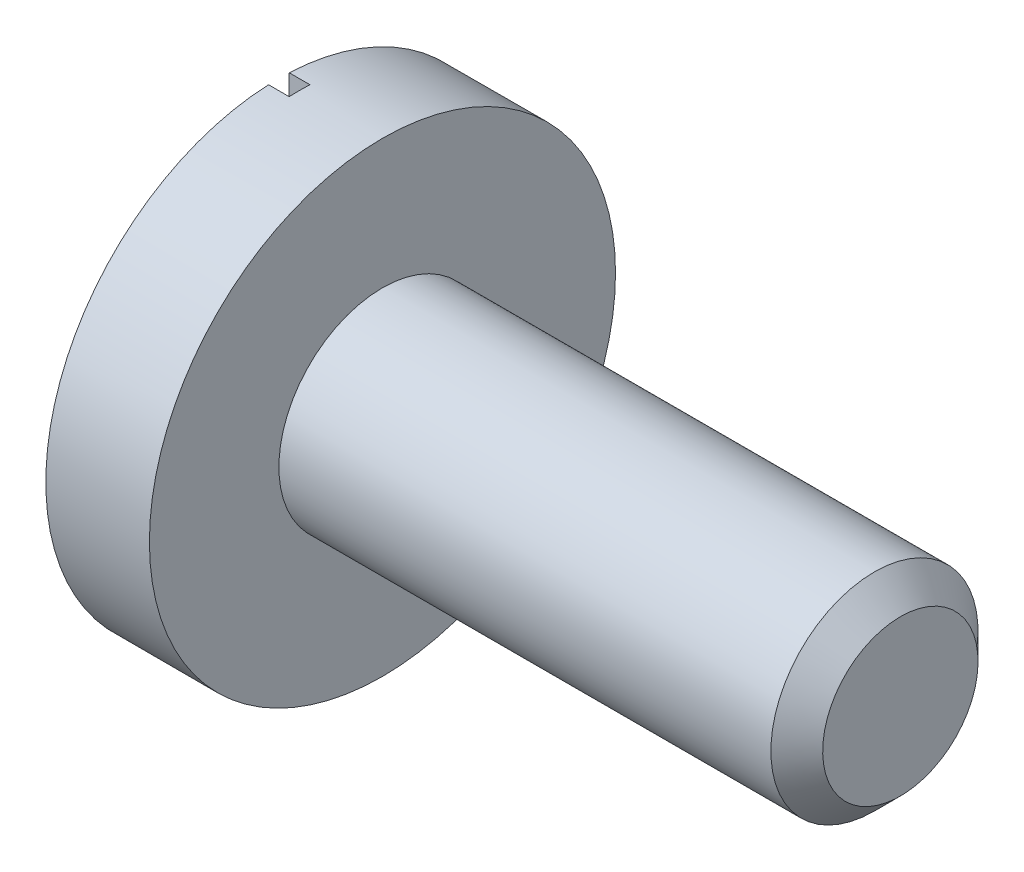
ISO-10303-21;
HEADER;
FILE_DESCRIPTION(('STEP AP214'),'2;1');
FILE_NAME('part.step','',(''),(''),'','','');
FILE_SCHEMA(('AUTOMOTIVE_DESIGN { 1 0 10303 214 1 1 1 1 }'));
ENDSEC;
DATA;
#1=APPLICATION_CONTEXT('core data for automotive mechanical design processes');
#2=APPLICATION_PROTOCOL_DEFINITION('international standard','automotive_design',2000,#1);
#3=PRODUCT_CONTEXT('',#1,'mechanical');
#4=PRODUCT('Part','Part','',(#3));
#5=PRODUCT_RELATED_PRODUCT_CATEGORY('part','',(#4));
#6=PRODUCT_DEFINITION_FORMATION('','',#4);
#7=PRODUCT_DEFINITION_CONTEXT('part definition',#1,'design');
#8=PRODUCT_DEFINITION('design','',#6,#7);
#9=PRODUCT_DEFINITION_SHAPE('','',#8);
#10=(LENGTH_UNIT() NAMED_UNIT(*) SI_UNIT(.MILLI.,.METRE.));
#11=(NAMED_UNIT(*) PLANE_ANGLE_UNIT() SI_UNIT($,.RADIAN.));
#12=(NAMED_UNIT(*) SI_UNIT($,.STERADIAN.) SOLID_ANGLE_UNIT());
#13=UNCERTAINTY_MEASURE_WITH_UNIT(LENGTH_MEASURE(1.E-05),#10,'distance_accuracy_value','');
#14=(GEOMETRIC_REPRESENTATION_CONTEXT(3) GLOBAL_UNCERTAINTY_ASSIGNED_CONTEXT((#13)) GLOBAL_UNIT_ASSIGNED_CONTEXT((#10,
#11,#12)) REPRESENTATION_CONTEXT('',''));
#15=CARTESIAN_POINT('',(0.,0.,0.));
#16=DIRECTION('',(0.,0.,1.));
#17=DIRECTION('',(1.,0.,0.));
#18=AXIS2_PLACEMENT_3D('',#15,#16,#17);
#19=CARTESIAN_POINT('',(0.,0.,0.));
#20=DIRECTION('',(-1.,0.,0.));
#21=DIRECTION('',(0.,-1.,0.));
#22=AXIS2_PLACEMENT_3D('',#19,#20,#21);
#23=PLANE('',#22);
#24=DIRECTION('',(0.,-1.,0.));
#25=VECTOR('',#24,1.);
#26=CARTESIAN_POINT('',(0.,1.12388833964945,-0.0500000000000003));
#27=LINE('',#26,#25);
#28=CARTESIAN_POINT('',(0.,1.12388833964945,-0.0500000000000001));
#29=VERTEX_POINT('',#28);
#30=CARTESIAN_POINT('',(0.,-1.12388833964945,-0.05));
#31=VERTEX_POINT('',#30);
#32=EDGE_CURVE('E75',#29,#31,#27,.T.);
#33=ORIENTED_EDGE('',*,*,#32,.F.);
#34=CARTESIAN_POINT('',(0.,0.,0.));
#35=DIRECTION('',(1.,0.,0.));
#36=DIRECTION('',(0.,1.,0.));
#37=AXIS2_PLACEMENT_3D('',#34,#35,#36);
#38=CIRCLE('',#37,1.125);
#39=EDGE_CURVE('E111',#31,#29,#38,.T.);
#40=ORIENTED_EDGE('',*,*,#39,.F.);
#41=EDGE_LOOP('',(#33,#40));
#42=FACE_BOUND('',#41,.T.);
#43=ADVANCED_FACE('F36',(#42),#23,.T.);
#44=DIRECTION('',(0.,1.,0.));
#45=VECTOR('',#44,1.);
#46=CARTESIAN_POINT('',(0.,1.12388833964945,0.0499999999999994));
#47=LINE('',#46,#45);
#48=CARTESIAN_POINT('',(0.,-1.12388833964945,0.0499999999999999));
#49=VERTEX_POINT('',#48);
#50=CARTESIAN_POINT('',(0.,1.12388833964945,0.0499999999999994));
#51=VERTEX_POINT('',#50);
#52=EDGE_CURVE('E230',#49,#51,#47,.T.);
#53=ORIENTED_EDGE('',*,*,#52,.F.);
#54=EDGE_CURVE('E97',#51,#49,#38,.T.);
#55=ORIENTED_EDGE('',*,*,#54,.F.);
#56=EDGE_LOOP('',(#53,#55));
#57=FACE_BOUND('',#56,.T.);
#58=ADVANCED_FACE('F129',(#57),#23,.T.);
#59=CARTESIAN_POINT('',(3.,0.,0.));
#60=DIRECTION('',(1.,0.,0.));
#61=DIRECTION('',(0.,1.,0.));
#62=AXIS2_PLACEMENT_3D('',#59,#60,#61);
#63=CYLINDRICAL_SURFACE('',#62,1.125);
#64=DIRECTION('',(-1.,0.,0.));
#65=VECTOR('',#64,1.);
#66=CARTESIAN_POINT('',(0.1,1.12388833964945,-0.0500000000000001));
#67=LINE('',#66,#65);
#68=CARTESIAN_POINT('',(0.1,1.12388833964945,-0.0500000000000001));
#69=VERTEX_POINT('',#68);
#70=EDGE_CURVE('E99',#69,#29,#67,.T.);
#71=ORIENTED_EDGE('',*,*,#70,.F.);
#72=CARTESIAN_POINT('',(0.1,0.,0.));
#73=DIRECTION('',(-1.,0.,0.));
#74=DIRECTION('',(0.,-1.,0.));
#75=AXIS2_PLACEMENT_3D('',#72,#73,#74);
#76=CIRCLE('',#75,1.125);
#77=CARTESIAN_POINT('',(0.1,1.12388833964945,0.0499999999999994));
#78=VERTEX_POINT('',#77);
#79=EDGE_CURVE('E57',#78,#69,#76,.T.);
#80=ORIENTED_EDGE('',*,*,#79,.F.);
#81=DIRECTION('',(-1.,0.,0.));
#82=VECTOR('',#81,1.);
#83=CARTESIAN_POINT('',(0.1,1.12388833964945,0.0499999999999994));
#84=LINE('',#83,#82);
#85=EDGE_CURVE('E85',#78,#51,#84,.T.);
#86=ORIENTED_EDGE('',*,*,#85,.T.);
#87=ORIENTED_EDGE('',*,*,#54,.T.);
#88=DIRECTION('',(-1.,0.,0.));
#89=VECTOR('',#88,1.);
#90=CARTESIAN_POINT('',(0.0999999999999996,-1.12388833964945,0.0499999999999999));
#91=LINE('',#90,#89);
#92=CARTESIAN_POINT('',(0.0999999999999996,-1.12388833964945,0.0499999999999999));
#93=VERTEX_POINT('',#92);
#94=EDGE_CURVE('E82',#93,#49,#91,.T.);
#95=ORIENTED_EDGE('',*,*,#94,.F.);
#96=CARTESIAN_POINT('',(0.1,0.,0.));
#97=DIRECTION('',(-1.,0.,0.));
#98=DIRECTION('',(0.,-1.,0.));
#99=AXIS2_PLACEMENT_3D('',#96,#97,#98);
#100=CIRCLE('',#99,1.125);
#101=CARTESIAN_POINT('',(0.0999999999999994,-1.12388833964945,-0.0500000000000001));
#102=VERTEX_POINT('',#101);
#103=EDGE_CURVE('E86',#102,#93,#100,.T.);
#104=ORIENTED_EDGE('',*,*,#103,.F.);
#105=DIRECTION('',(-1.,0.,0.));
#106=VECTOR('',#105,1.);
#107=CARTESIAN_POINT('',(0.0999999999999996,-1.12388833964945,-0.05));
#108=LINE('',#107,#106);
#109=EDGE_CURVE('E108',#102,#31,#108,.T.);
#110=ORIENTED_EDGE('',*,*,#109,.T.);
#111=ORIENTED_EDGE('',*,*,#39,.T.);
#112=EDGE_LOOP('',(#71,#80,#86,#87,#95,#104,#110,#111));
#113=FACE_BOUND('',#112,.T.);
#114=CARTESIAN_POINT('',(0.5,0.,0.));
#115=DIRECTION('',(1.,0.,0.));
#116=DIRECTION('',(0.,1.,0.));
#117=AXIS2_PLACEMENT_3D('',#114,#115,#116);
#118=CIRCLE('',#117,1.125);
#119=CARTESIAN_POINT('',(0.5,1.125,0.));
#120=VERTEX_POINT('',#119);
#121=EDGE_CURVE('E107',#120,#120,#118,.T.);
#122=ORIENTED_EDGE('',*,*,#121,.F.);
#123=EDGE_LOOP('',(#122));
#124=FACE_BOUND('',#123,.T.);
#125=ADVANCED_FACE('F94',(#113,#124),#63,.T.);
#126=CARTESIAN_POINT('',(0.5,1.125,0.));
#127=DIRECTION('',(1.,0.,0.));
#128=DIRECTION('',(0.,1.,0.));
#129=AXIS2_PLACEMENT_3D('',#126,#127,#128);
#130=PLANE('',#129);
#131=ORIENTED_EDGE('',*,*,#121,.T.);
#132=EDGE_LOOP('',(#131));
#133=FACE_BOUND('',#132,.T.);
#134=CARTESIAN_POINT('',(0.5,0.,0.));
#135=DIRECTION('',(1.,0.,0.));
#136=DIRECTION('',(0.,1.,0.));
#137=AXIS2_PLACEMENT_3D('',#134,#135,#136);
#138=CIRCLE('',#137,0.5);
#139=CARTESIAN_POINT('',(0.5,0.5,0.));
#140=VERTEX_POINT('',#139);
#141=EDGE_CURVE('E104',#140,#140,#138,.T.);
#142=ORIENTED_EDGE('',*,*,#141,.F.);
#143=EDGE_LOOP('',(#142));
#144=FACE_BOUND('',#143,.T.);
#145=ADVANCED_FACE('F138',(#133,#144),#130,.T.);
#146=CARTESIAN_POINT('',(3.,0.,0.));
#147=DIRECTION('',(1.,0.,0.));
#148=DIRECTION('',(0.,1.,0.));
#149=AXIS2_PLACEMENT_3D('',#146,#147,#148);
#150=CYLINDRICAL_SURFACE('',#149,0.5);
#151=CARTESIAN_POINT('',(2.875,0.,0.));
#152=DIRECTION('',(1.,0.,0.));
#153=DIRECTION('',(0.,1.,0.));
#154=AXIS2_PLACEMENT_3D('',#151,#152,#153);
#155=CIRCLE('',#154,0.5);
#156=CARTESIAN_POINT('',(2.875,0.5,0.));
#157=VERTEX_POINT('',#156);
#158=EDGE_CURVE('E11',#157,#157,#155,.F.);
#159=ORIENTED_EDGE('',*,*,#158,.T.);
#160=EDGE_LOOP('',(#159));
#161=FACE_BOUND('',#160,.T.);
#162=ORIENTED_EDGE('',*,*,#141,.T.);
#163=EDGE_LOOP('',(#162));
#164=FACE_BOUND('',#163,.T.);
#165=ADVANCED_FACE('F125',(#161,#164),#150,.T.);
#166=CARTESIAN_POINT('',(3.,0.,0.));
#167=DIRECTION('',(1.,0.,0.));
#168=DIRECTION('',(0.,1.,0.));
#169=AXIS2_PLACEMENT_3D('',#166,#167,#168);
#170=PLANE('',#169);
#171=CARTESIAN_POINT('',(3.,0.,0.));
#172=DIRECTION('',(1.,0.,0.));
#173=DIRECTION('',(0.,1.,0.));
#174=AXIS2_PLACEMENT_3D('',#171,#172,#173);
#175=CIRCLE('',#174,0.375000000000001);
#176=CARTESIAN_POINT('',(3.,0.375000000000001,0.));
#177=VERTEX_POINT('',#176);
#178=EDGE_CURVE('E44',#177,#177,#175,.T.);
#179=ORIENTED_EDGE('',*,*,#178,.T.);
#180=EDGE_LOOP('',(#179));
#181=FACE_BOUND('',#180,.T.);
#182=ADVANCED_FACE('F115',(#181),#170,.T.);
#183=CARTESIAN_POINT('',(3.,0.,0.));
#184=DIRECTION('',(-1.,0.,0.));
#185=DIRECTION('',(0.,-1.,0.));
#186=AXIS2_PLACEMENT_3D('',#183,#184,#185);
#187=CONICAL_SURFACE('',#186,0.375000000000001,0.785398163397446);
#188=ORIENTED_EDGE('',*,*,#158,.F.);
#189=EDGE_LOOP('',(#188));
#190=FACE_BOUND('',#189,.T.);
#191=ORIENTED_EDGE('',*,*,#178,.F.);
#192=EDGE_LOOP('',(#191));
#193=FACE_BOUND('',#192,.T.);
#194=ADVANCED_FACE('F38',(#190,#193),#187,.T.);
#195=CARTESIAN_POINT('',(0.1,1.12388833964945,-0.0500000000000003));
#196=DIRECTION('',(0.,0.,-1.));
#197=DIRECTION('',(0.,1.,0.));
#198=AXIS2_PLACEMENT_3D('',#195,#196,#197);
#199=PLANE('',#198);
#200=ORIENTED_EDGE('',*,*,#32,.T.);
#201=ORIENTED_EDGE('',*,*,#109,.F.);
#202=DIRECTION('',(0.,-1.,0.));
#203=VECTOR('',#202,1.);
#204=CARTESIAN_POINT('',(0.1,1.12388833964945,-0.0500000000000003));
#205=LINE('',#204,#203);
#206=EDGE_CURVE('E51',#69,#102,#205,.T.);
#207=ORIENTED_EDGE('',*,*,#206,.F.);
#208=ORIENTED_EDGE('',*,*,#70,.T.);
#209=EDGE_LOOP('',(#200,#201,#207,#208));
#210=FACE_BOUND('',#209,.T.);
#211=ADVANCED_FACE('F118',(#210),#199,.F.);
#212=CARTESIAN_POINT('',(0.1,1.12388833964945,0.0499999999999994));
#213=DIRECTION('',(0.,0.,1.));
#214=DIRECTION('',(0.,-1.,0.));
#215=AXIS2_PLACEMENT_3D('',#212,#213,#214);
#216=PLANE('',#215);
#217=ORIENTED_EDGE('',*,*,#52,.T.);
#218=ORIENTED_EDGE('',*,*,#85,.F.);
#219=DIRECTION('',(0.,1.,0.));
#220=VECTOR('',#219,1.);
#221=CARTESIAN_POINT('',(0.1,1.12388833964945,0.0499999999999994));
#222=LINE('',#221,#220);
#223=EDGE_CURVE('E79',#93,#78,#222,.T.);
#224=ORIENTED_EDGE('',*,*,#223,.F.);
#225=ORIENTED_EDGE('',*,*,#94,.T.);
#226=EDGE_LOOP('',(#217,#218,#224,#225));
#227=FACE_BOUND('',#226,.T.);
#228=ADVANCED_FACE('F80',(#227),#216,.F.);
#229=CARTESIAN_POINT('',(0.1,0.,0.));
#230=DIRECTION('',(-1.,0.,0.));
#231=DIRECTION('',(0.,-1.,0.));
#232=AXIS2_PLACEMENT_3D('',#229,#230,#231);
#233=PLANE('',#232);
#234=ORIENTED_EDGE('',*,*,#103,.T.);
#235=ORIENTED_EDGE('',*,*,#223,.T.);
#236=ORIENTED_EDGE('',*,*,#79,.T.);
#237=ORIENTED_EDGE('',*,*,#206,.T.);
#238=EDGE_LOOP('',(#234,#235,#236,#237));
#239=FACE_BOUND('',#238,.T.);
#240=ADVANCED_FACE('F89',(#239),#233,.T.);
#241=CLOSED_SHELL('',(#43,#58,#125,#145,#165,#182,#194,#211,#228,#240));
#242=MANIFOLD_SOLID_BREP('B2',#241);
#243=ADVANCED_BREP_SHAPE_REPRESENTATION('',(#18,#242),#14);
#244=SHAPE_DEFINITION_REPRESENTATION(#9,#243);
ENDSEC;
END-ISO-10303-21;
